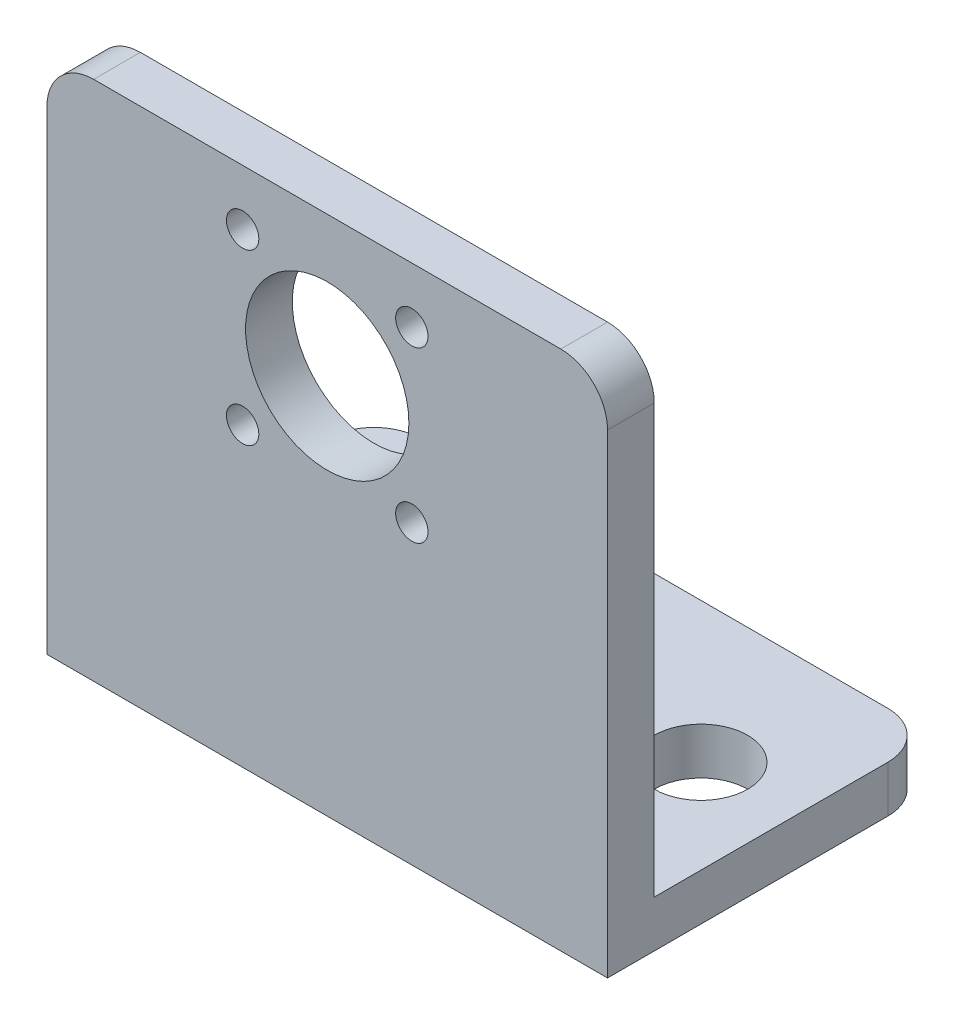
ISO-10303-21;
HEADER;
FILE_DESCRIPTION(('STEP AP214'),'2;1');
FILE_NAME('part.step','',(''),(''),'','','');
FILE_SCHEMA(('AUTOMOTIVE_DESIGN { 1 0 10303 214 1 1 1 1 }'));
ENDSEC;
DATA;
#1=APPLICATION_CONTEXT('core data for automotive mechanical design processes');
#2=APPLICATION_PROTOCOL_DEFINITION('international standard','automotive_design',2000,#1);
#3=PRODUCT_CONTEXT('',#1,'mechanical');
#4=PRODUCT('Part','Part','',(#3));
#5=PRODUCT_RELATED_PRODUCT_CATEGORY('part','',(#4));
#6=PRODUCT_DEFINITION_FORMATION('','',#4);
#7=PRODUCT_DEFINITION_CONTEXT('part definition',#1,'design');
#8=PRODUCT_DEFINITION('design','',#6,#7);
#9=PRODUCT_DEFINITION_SHAPE('','',#8);
#10=(LENGTH_UNIT() NAMED_UNIT(*) SI_UNIT(.MILLI.,.METRE.));
#11=(NAMED_UNIT(*) PLANE_ANGLE_UNIT() SI_UNIT($,.RADIAN.));
#12=(NAMED_UNIT(*) SI_UNIT($,.STERADIAN.) SOLID_ANGLE_UNIT());
#13=UNCERTAINTY_MEASURE_WITH_UNIT(LENGTH_MEASURE(1.E-05),#10,'distance_accuracy_value','');
#14=(GEOMETRIC_REPRESENTATION_CONTEXT(3) GLOBAL_UNCERTAINTY_ASSIGNED_CONTEXT((#13)) GLOBAL_UNIT_ASSIGNED_CONTEXT((#10,
#11,#12)) REPRESENTATION_CONTEXT('',''));
#15=CARTESIAN_POINT('',(0.,0.,0.));
#16=DIRECTION('',(0.,0.,1.));
#17=DIRECTION('',(1.,0.,0.));
#18=AXIS2_PLACEMENT_3D('',#15,#16,#17);
#19=CARTESIAN_POINT('',(0.,0.,0.));
#20=DIRECTION('',(0.,0.,1.));
#21=DIRECTION('',(1.,0.,0.));
#22=AXIS2_PLACEMENT_3D('',#19,#20,#21);
#23=PLANE('',#22);
#24=CARTESIAN_POINT('',(5.75,5.75,0.));
#25=DIRECTION('',(0.,0.,1.));
#26=DIRECTION('',(1.,0.,0.));
#27=AXIS2_PLACEMENT_3D('',#24,#25,#26);
#28=CIRCLE('',#27,1.1);
#29=CARTESIAN_POINT('',(6.85,5.75,0.));
#30=VERTEX_POINT('',#29);
#31=EDGE_CURVE('E350',#30,#30,#28,.T.);
#32=ORIENTED_EDGE('',*,*,#31,.T.);
#33=EDGE_LOOP('',(#32));
#34=FACE_BOUND('',#33,.T.);
#35=CARTESIAN_POINT('',(-5.75,5.75,0.));
#36=DIRECTION('',(0.,0.,1.));
#37=DIRECTION('',(1.,0.,0.));
#38=AXIS2_PLACEMENT_3D('',#35,#36,#37);
#39=CIRCLE('',#38,1.1);
#40=CARTESIAN_POINT('',(-4.65,5.75,0.));
#41=VERTEX_POINT('',#40);
#42=EDGE_CURVE('E342',#41,#41,#39,.T.);
#43=ORIENTED_EDGE('',*,*,#42,.T.);
#44=EDGE_LOOP('',(#43));
#45=FACE_BOUND('',#44,.T.);
#46=CARTESIAN_POINT('',(5.75,-5.75,0.));
#47=DIRECTION('',(0.,0.,1.));
#48=DIRECTION('',(1.,0.,0.));
#49=AXIS2_PLACEMENT_3D('',#46,#47,#48);
#50=CIRCLE('',#49,1.1);
#51=CARTESIAN_POINT('',(6.85,-5.75,0.));
#52=VERTEX_POINT('',#51);
#53=EDGE_CURVE('E337',#52,#52,#50,.T.);
#54=ORIENTED_EDGE('',*,*,#53,.T.);
#55=EDGE_LOOP('',(#54));
#56=FACE_BOUND('',#55,.T.);
#57=CARTESIAN_POINT('',(-5.75,-5.75,0.));
#58=DIRECTION('',(0.,0.,1.));
#59=DIRECTION('',(1.,0.,0.));
#60=AXIS2_PLACEMENT_3D('',#57,#58,#59);
#61=CIRCLE('',#60,1.1);
#62=CARTESIAN_POINT('',(-4.65,-5.75,0.));
#63=VERTEX_POINT('',#62);
#64=EDGE_CURVE('E137',#63,#63,#61,.T.);
#65=ORIENTED_EDGE('',*,*,#64,.T.);
#66=EDGE_LOOP('',(#65));
#67=FACE_BOUND('',#66,.T.);
#68=CARTESIAN_POINT('',(0.,0.,0.));
#69=DIRECTION('',(0.,0.,1.));
#70=DIRECTION('',(1.,0.,0.));
#71=AXIS2_PLACEMENT_3D('',#68,#69,#70);
#72=CIRCLE('',#71,5.55);
#73=CARTESIAN_POINT('',(5.55,0.,0.));
#74=VERTEX_POINT('',#73);
#75=EDGE_CURVE('E147',#74,#74,#72,.T.);
#76=ORIENTED_EDGE('',*,*,#75,.T.);
#77=EDGE_LOOP('',(#76));
#78=FACE_BOUND('',#77,.T.);
#79=DIRECTION('',(0.,-1.,0.));
#80=VECTOR('',#79,1.);
#81=CARTESIAN_POINT('',(-19.05,9.525,0.));
#82=LINE('',#81,#80);
#83=CARTESIAN_POINT('',(-19.05,6.35,0.));
#84=VERTEX_POINT('',#83);
#85=CARTESIAN_POINT('',(-19.05,-22.733,0.));
#86=VERTEX_POINT('',#85);
#87=EDGE_CURVE('E131',#84,#86,#82,.T.);
#88=ORIENTED_EDGE('',*,*,#87,.F.);
#89=CARTESIAN_POINT('',(-15.875,6.35,0.));
#90=DIRECTION('',(0.,0.,1.));
#91=DIRECTION('',(1.,0.,0.));
#92=AXIS2_PLACEMENT_3D('',#89,#90,#91);
#93=CIRCLE('',#92,3.175);
#94=CARTESIAN_POINT('',(-15.875,9.525,0.));
#95=VERTEX_POINT('',#94);
#96=EDGE_CURVE('E191',#84,#95,#93,.F.);
#97=ORIENTED_EDGE('',*,*,#96,.T.);
#98=DIRECTION('',(-1.,0.,0.));
#99=VECTOR('',#98,1.);
#100=CARTESIAN_POINT('',(-19.05,9.525,0.));
#101=LINE('',#100,#99);
#102=CARTESIAN_POINT('',(15.875,9.52500000000001,0.));
#103=VERTEX_POINT('',#102);
#104=EDGE_CURVE('E130',#103,#95,#101,.T.);
#105=ORIENTED_EDGE('',*,*,#104,.F.);
#106=CARTESIAN_POINT('',(15.875,6.35,0.));
#107=DIRECTION('',(0.,0.,1.));
#108=DIRECTION('',(1.,0.,0.));
#109=AXIS2_PLACEMENT_3D('',#106,#107,#108);
#110=CIRCLE('',#109,3.175);
#111=CARTESIAN_POINT('',(19.05,6.35,0.));
#112=VERTEX_POINT('',#111);
#113=EDGE_CURVE('E129',#103,#112,#110,.F.);
#114=ORIENTED_EDGE('',*,*,#113,.T.);
#115=DIRECTION('',(0.,1.,0.));
#116=VECTOR('',#115,1.);
#117=CARTESIAN_POINT('',(19.05,9.52500000000001,0.));
#118=LINE('',#117,#116);
#119=CARTESIAN_POINT('',(19.05,-22.733,0.));
#120=VERTEX_POINT('',#119);
#121=EDGE_CURVE('E114',#120,#112,#118,.T.);
#122=ORIENTED_EDGE('',*,*,#121,.F.);
#123=DIRECTION('',(1.,0.,0.));
#124=VECTOR('',#123,1.);
#125=CARTESIAN_POINT('',(-19.05,-22.733,0.));
#126=LINE('',#125,#124);
#127=EDGE_CURVE('E127',#86,#120,#126,.T.);
#128=ORIENTED_EDGE('',*,*,#127,.F.);
#129=EDGE_LOOP('',(#88,#97,#105,#114,#122,#128));
#130=FACE_BOUND('',#129,.T.);
#131=ADVANCED_FACE('F33',(#34,#45,#56,#67,#78,#130),#23,.F.);
#132=CARTESIAN_POINT('',(0.,0.,3.175));
#133=DIRECTION('',(0.,0.,1.));
#134=DIRECTION('',(1.,0.,0.));
#135=AXIS2_PLACEMENT_3D('',#132,#133,#134);
#136=PLANE('',#135);
#137=CARTESIAN_POINT('',(5.75,5.75,3.175));
#138=DIRECTION('',(0.,0.,1.));
#139=DIRECTION('',(1.,0.,0.));
#140=AXIS2_PLACEMENT_3D('',#137,#138,#139);
#141=CIRCLE('',#140,1.1);
#142=CARTESIAN_POINT('',(6.85,5.75,3.175));
#143=VERTEX_POINT('',#142);
#144=EDGE_CURVE('E352',#143,#143,#141,.T.);
#145=ORIENTED_EDGE('',*,*,#144,.F.);
#146=EDGE_LOOP('',(#145));
#147=FACE_BOUND('',#146,.T.);
#148=CARTESIAN_POINT('',(-5.75,5.75,3.175));
#149=DIRECTION('',(0.,0.,1.));
#150=DIRECTION('',(1.,0.,0.));
#151=AXIS2_PLACEMENT_3D('',#148,#149,#150);
#152=CIRCLE('',#151,1.1);
#153=CARTESIAN_POINT('',(-4.65,5.75,3.175));
#154=VERTEX_POINT('',#153);
#155=EDGE_CURVE('E347',#154,#154,#152,.T.);
#156=ORIENTED_EDGE('',*,*,#155,.F.);
#157=EDGE_LOOP('',(#156));
#158=FACE_BOUND('',#157,.T.);
#159=CARTESIAN_POINT('',(5.75,-5.75,3.175));
#160=DIRECTION('',(0.,0.,1.));
#161=DIRECTION('',(1.,0.,0.));
#162=AXIS2_PLACEMENT_3D('',#159,#160,#161);
#163=CIRCLE('',#162,1.1);
#164=CARTESIAN_POINT('',(6.85,-5.75,3.175));
#165=VERTEX_POINT('',#164);
#166=EDGE_CURVE('E334',#165,#165,#163,.T.);
#167=ORIENTED_EDGE('',*,*,#166,.F.);
#168=EDGE_LOOP('',(#167));
#169=FACE_BOUND('',#168,.T.);
#170=CARTESIAN_POINT('',(-5.75,-5.75,3.175));
#171=DIRECTION('',(0.,0.,1.));
#172=DIRECTION('',(1.,0.,0.));
#173=AXIS2_PLACEMENT_3D('',#170,#171,#172);
#174=CIRCLE('',#173,1.1);
#175=CARTESIAN_POINT('',(-4.65,-5.75,3.175));
#176=VERTEX_POINT('',#175);
#177=EDGE_CURVE('E142',#176,#176,#174,.T.);
#178=ORIENTED_EDGE('',*,*,#177,.F.);
#179=EDGE_LOOP('',(#178));
#180=FACE_BOUND('',#179,.T.);
#181=DIRECTION('',(-1.,0.,0.));
#182=VECTOR('',#181,1.);
#183=CARTESIAN_POINT('',(-19.05,9.525,3.175));
#184=LINE('',#183,#182);
#185=CARTESIAN_POINT('',(15.875,9.52500000000001,3.175));
#186=VERTEX_POINT('',#185);
#187=CARTESIAN_POINT('',(-15.875,9.525,3.175));
#188=VERTEX_POINT('',#187);
#189=EDGE_CURVE('E159',#186,#188,#184,.T.);
#190=ORIENTED_EDGE('',*,*,#189,.T.);
#191=CARTESIAN_POINT('',(-15.875,6.35,3.175));
#192=DIRECTION('',(0.,0.,1.));
#193=DIRECTION('',(1.,0.,0.));
#194=AXIS2_PLACEMENT_3D('',#191,#192,#193);
#195=CIRCLE('',#194,3.175);
#196=CARTESIAN_POINT('',(-19.05,6.35,3.175));
#197=VERTEX_POINT('',#196);
#198=EDGE_CURVE('E11',#188,#197,#195,.T.);
#199=ORIENTED_EDGE('',*,*,#198,.T.);
#200=DIRECTION('',(0.,-1.,0.));
#201=VECTOR('',#200,1.);
#202=CARTESIAN_POINT('',(-19.05,9.525,3.175));
#203=LINE('',#202,#201);
#204=CARTESIAN_POINT('',(-19.05,-25.908,3.175));
#205=VERTEX_POINT('',#204);
#206=EDGE_CURVE('E153',#197,#205,#203,.T.);
#207=ORIENTED_EDGE('',*,*,#206,.T.);
#208=DIRECTION('',(1.,0.,0.));
#209=VECTOR('',#208,1.);
#210=CARTESIAN_POINT('',(-19.05,-25.908,3.175));
#211=LINE('',#210,#209);
#212=CARTESIAN_POINT('',(19.05,-25.908,3.175));
#213=VERTEX_POINT('',#212);
#214=EDGE_CURVE('E155',#205,#213,#211,.T.);
#215=ORIENTED_EDGE('',*,*,#214,.T.);
#216=DIRECTION('',(0.,1.,0.));
#217=VECTOR('',#216,1.);
#218=CARTESIAN_POINT('',(19.05,9.52500000000001,3.175));
#219=LINE('',#218,#217);
#220=CARTESIAN_POINT('',(19.05,6.35,3.175));
#221=VERTEX_POINT('',#220);
#222=EDGE_CURVE('E157',#213,#221,#219,.T.);
#223=ORIENTED_EDGE('',*,*,#222,.T.);
#224=CARTESIAN_POINT('',(15.875,6.35,3.175));
#225=DIRECTION('',(0.,0.,1.));
#226=DIRECTION('',(1.,0.,0.));
#227=AXIS2_PLACEMENT_3D('',#224,#225,#226);
#228=CIRCLE('',#227,3.175);
#229=EDGE_CURVE('E41',#221,#186,#228,.T.);
#230=ORIENTED_EDGE('',*,*,#229,.T.);
#231=EDGE_LOOP('',(#190,#199,#207,#215,#223,#230));
#232=FACE_BOUND('',#231,.T.);
#233=CARTESIAN_POINT('',(0.,0.,3.175));
#234=DIRECTION('',(0.,0.,1.));
#235=DIRECTION('',(1.,0.,0.));
#236=AXIS2_PLACEMENT_3D('',#233,#234,#235);
#237=CIRCLE('',#236,5.55);
#238=CARTESIAN_POINT('',(5.55,0.,3.175));
#239=VERTEX_POINT('',#238);
#240=EDGE_CURVE('E148',#239,#239,#237,.T.);
#241=ORIENTED_EDGE('',*,*,#240,.F.);
#242=EDGE_LOOP('',(#241));
#243=FACE_BOUND('',#242,.T.);
#244=ADVANCED_FACE('F208',(#147,#158,#169,#180,#232,#243),#136,.T.);
#245=CARTESIAN_POINT('',(-19.05,9.525,3.175));
#246=DIRECTION('',(1.,0.,0.));
#247=DIRECTION('',(0.,1.,0.));
#248=AXIS2_PLACEMENT_3D('',#245,#246,#247);
#249=PLANE('',#248);
#250=DIRECTION('',(0.,0.,1.));
#251=VECTOR('',#250,1.);
#252=CARTESIAN_POINT('',(-19.05,-22.733,-19.05));
#253=LINE('',#252,#251);
#254=CARTESIAN_POINT('',(-19.05,-22.733,-15.875));
#255=VERTEX_POINT('',#254);
#256=EDGE_CURVE('E121',#255,#86,#253,.T.);
#257=ORIENTED_EDGE('',*,*,#256,.F.);
#258=DIRECTION('',(0.,1.,0.));
#259=VECTOR('',#258,1.);
#260=CARTESIAN_POINT('',(-19.05,-25.908,-15.875));
#261=LINE('',#260,#259);
#262=CARTESIAN_POINT('',(-19.05,-25.908,-15.875));
#263=VERTEX_POINT('',#262);
#264=EDGE_CURVE('E188',#255,#263,#261,.F.);
#265=ORIENTED_EDGE('',*,*,#264,.T.);
#266=DIRECTION('',(0.,0.,-1.));
#267=VECTOR('',#266,1.);
#268=CARTESIAN_POINT('',(-19.05,-25.908,3.175));
#269=LINE('',#268,#267);
#270=EDGE_CURVE('E165',#205,#263,#269,.T.);
#271=ORIENTED_EDGE('',*,*,#270,.F.);
#272=ORIENTED_EDGE('',*,*,#206,.F.);
#273=DIRECTION('',(0.,0.,-1.));
#274=VECTOR('',#273,1.);
#275=CARTESIAN_POINT('',(-19.05,6.35,3.175));
#276=LINE('',#275,#274);
#277=EDGE_CURVE('E185',#197,#84,#276,.T.);
#278=ORIENTED_EDGE('',*,*,#277,.T.);
#279=ORIENTED_EDGE('',*,*,#87,.T.);
#280=EDGE_LOOP('',(#257,#265,#271,#272,#278,#279));
#281=FACE_BOUND('',#280,.T.);
#282=ADVANCED_FACE('F205',(#281),#249,.F.);
#283=CARTESIAN_POINT('',(-19.05,-25.908,3.175));
#284=DIRECTION('',(0.,1.,0.));
#285=DIRECTION('',(-1.,0.,0.));
#286=AXIS2_PLACEMENT_3D('',#283,#284,#285);
#287=PLANE('',#286);
#288=CARTESIAN_POINT('',(-12.7,-25.908,-9.525));
#289=DIRECTION('',(0.,1.,0.));
#290=DIRECTION('',(0.,0.,1.));
#291=AXIS2_PLACEMENT_3D('',#288,#289,#290);
#292=CIRCLE('',#291,3.175);
#293=CARTESIAN_POINT('',(-12.7,-25.908,-6.35));
#294=VERTEX_POINT('',#293);
#295=EDGE_CURVE('E361',#294,#294,#292,.T.);
#296=ORIENTED_EDGE('',*,*,#295,.T.);
#297=EDGE_LOOP('',(#296));
#298=FACE_BOUND('',#297,.T.);
#299=CARTESIAN_POINT('',(12.7,-25.908,-9.525));
#300=DIRECTION('',(0.,1.,0.));
#301=DIRECTION('',(0.,0.,1.));
#302=AXIS2_PLACEMENT_3D('',#299,#300,#301);
#303=CIRCLE('',#302,3.175);
#304=CARTESIAN_POINT('',(12.7,-25.908,-6.35));
#305=VERTEX_POINT('',#304);
#306=EDGE_CURVE('E355',#305,#305,#303,.T.);
#307=ORIENTED_EDGE('',*,*,#306,.T.);
#308=EDGE_LOOP('',(#307));
#309=FACE_BOUND('',#308,.T.);
#310=DIRECTION('',(-1.,0.,0.));
#311=VECTOR('',#310,1.);
#312=CARTESIAN_POINT('',(-19.05,-25.908,-19.05));
#313=LINE('',#312,#311);
#314=CARTESIAN_POINT('',(15.875,-25.908,-19.05));
#315=VERTEX_POINT('',#314);
#316=CARTESIAN_POINT('',(-15.875,-25.908,-19.05));
#317=VERTEX_POINT('',#316);
#318=EDGE_CURVE('E122',#315,#317,#313,.T.);
#319=ORIENTED_EDGE('',*,*,#318,.F.);
#320=CARTESIAN_POINT('',(15.875,-25.908,-15.875));
#321=DIRECTION('',(0.,1.,0.));
#322=DIRECTION('',(-1.,0.,0.));
#323=AXIS2_PLACEMENT_3D('',#320,#321,#322);
#324=CIRCLE('',#323,3.175);
#325=CARTESIAN_POINT('',(19.05,-25.908,-15.875));
#326=VERTEX_POINT('',#325);
#327=EDGE_CURVE('E176',#315,#326,#324,.F.);
#328=ORIENTED_EDGE('',*,*,#327,.T.);
#329=DIRECTION('',(0.,0.,-1.));
#330=VECTOR('',#329,1.);
#331=CARTESIAN_POINT('',(19.05,-25.908,3.175));
#332=LINE('',#331,#330);
#333=EDGE_CURVE('E161',#213,#326,#332,.T.);
#334=ORIENTED_EDGE('',*,*,#333,.F.);
#335=ORIENTED_EDGE('',*,*,#214,.F.);
#336=ORIENTED_EDGE('',*,*,#270,.T.);
#337=CARTESIAN_POINT('',(-15.875,-25.908,-15.875));
#338=DIRECTION('',(0.,1.,0.));
#339=DIRECTION('',(-1.,0.,0.));
#340=AXIS2_PLACEMENT_3D('',#337,#338,#339);
#341=CIRCLE('',#340,3.175);
#342=EDGE_CURVE('E174',#263,#317,#341,.F.);
#343=ORIENTED_EDGE('',*,*,#342,.T.);
#344=EDGE_LOOP('',(#319,#328,#334,#335,#336,#343));
#345=FACE_BOUND('',#344,.T.);
#346=ADVANCED_FACE('F213',(#298,#309,#345),#287,.F.);
#347=CARTESIAN_POINT('',(19.05,9.52500000000001,3.175));
#348=DIRECTION('',(-1.,0.,0.));
#349=DIRECTION('',(0.,0.,1.));
#350=AXIS2_PLACEMENT_3D('',#347,#348,#349);
#351=PLANE('',#350);
#352=ORIENTED_EDGE('',*,*,#333,.T.);
#353=DIRECTION('',(0.,-1.,0.));
#354=VECTOR('',#353,1.);
#355=CARTESIAN_POINT('',(19.05,-22.733,-15.875));
#356=LINE('',#355,#354);
#357=CARTESIAN_POINT('',(19.05,-22.733,-15.875));
#358=VERTEX_POINT('',#357);
#359=EDGE_CURVE('E117',#326,#358,#356,.F.);
#360=ORIENTED_EDGE('',*,*,#359,.T.);
#361=DIRECTION('',(0.,0.,1.));
#362=VECTOR('',#361,1.);
#363=CARTESIAN_POINT('',(19.05,-22.733,-19.05));
#364=LINE('',#363,#362);
#365=EDGE_CURVE('E110',#358,#120,#364,.T.);
#366=ORIENTED_EDGE('',*,*,#365,.T.);
#367=ORIENTED_EDGE('',*,*,#121,.T.);
#368=DIRECTION('',(0.,0.,-1.));
#369=VECTOR('',#368,1.);
#370=CARTESIAN_POINT('',(19.05,6.35,3.175));
#371=LINE('',#370,#369);
#372=EDGE_CURVE('E178',#112,#221,#371,.F.);
#373=ORIENTED_EDGE('',*,*,#372,.T.);
#374=ORIENTED_EDGE('',*,*,#222,.F.);
#375=EDGE_LOOP('',(#352,#360,#366,#367,#373,#374));
#376=FACE_BOUND('',#375,.T.);
#377=ADVANCED_FACE('F113',(#376),#351,.F.);
#378=CARTESIAN_POINT('',(-19.05,9.525,3.175));
#379=DIRECTION('',(0.,-1.,0.));
#380=DIRECTION('',(1.,0.,0.));
#381=AXIS2_PLACEMENT_3D('',#378,#379,#380);
#382=PLANE('',#381);
#383=ORIENTED_EDGE('',*,*,#104,.T.);
#384=DIRECTION('',(0.,0.,-1.));
#385=VECTOR('',#384,1.);
#386=CARTESIAN_POINT('',(-15.875,9.525,3.175));
#387=LINE('',#386,#385);
#388=EDGE_CURVE('E48',#95,#188,#387,.F.);
#389=ORIENTED_EDGE('',*,*,#388,.T.);
#390=ORIENTED_EDGE('',*,*,#189,.F.);
#391=DIRECTION('',(0.,0.,-1.));
#392=VECTOR('',#391,1.);
#393=CARTESIAN_POINT('',(15.875,9.52500000000001,3.175));
#394=LINE('',#393,#392);
#395=EDGE_CURVE('E193',#186,#103,#394,.T.);
#396=ORIENTED_EDGE('',*,*,#395,.T.);
#397=EDGE_LOOP('',(#383,#389,#390,#396));
#398=FACE_BOUND('',#397,.T.);
#399=ADVANCED_FACE('F197',(#398),#382,.F.);
#400=CARTESIAN_POINT('',(0.,0.,3.175));
#401=DIRECTION('',(0.,0.,-1.));
#402=DIRECTION('',(-1.,0.,0.));
#403=AXIS2_PLACEMENT_3D('',#400,#401,#402);
#404=CYLINDRICAL_SURFACE('',#403,5.55);
#405=ORIENTED_EDGE('',*,*,#240,.T.);
#406=EDGE_LOOP('',(#405));
#407=FACE_BOUND('',#406,.T.);
#408=ORIENTED_EDGE('',*,*,#75,.F.);
#409=EDGE_LOOP('',(#408));
#410=FACE_BOUND('',#409,.T.);
#411=ADVANCED_FACE('F240',(#407,#410),#404,.F.);
#412=CARTESIAN_POINT('',(-19.05,-22.733,-19.05));
#413=DIRECTION('',(0.,-1.,0.));
#414=DIRECTION('',(1.,0.,0.));
#415=AXIS2_PLACEMENT_3D('',#412,#413,#414);
#416=PLANE('',#415);
#417=CARTESIAN_POINT('',(-12.7,-22.733,-9.525));
#418=DIRECTION('',(0.,1.,0.));
#419=DIRECTION('',(0.,0.,1.));
#420=AXIS2_PLACEMENT_3D('',#417,#418,#419);
#421=CIRCLE('',#420,3.17499999999999);
#422=CARTESIAN_POINT('',(-12.7,-22.733,-6.35000000000001));
#423=VERTEX_POINT('',#422);
#424=EDGE_CURVE('E364',#423,#423,#421,.T.);
#425=ORIENTED_EDGE('',*,*,#424,.F.);
#426=EDGE_LOOP('',(#425));
#427=FACE_BOUND('',#426,.T.);
#428=CARTESIAN_POINT('',(12.7,-22.733,-9.525));
#429=DIRECTION('',(0.,1.,0.));
#430=DIRECTION('',(0.,0.,1.));
#431=AXIS2_PLACEMENT_3D('',#428,#429,#430);
#432=CIRCLE('',#431,3.17499999999999);
#433=CARTESIAN_POINT('',(12.7,-22.733,-6.35000000000001));
#434=VERTEX_POINT('',#433);
#435=EDGE_CURVE('E358',#434,#434,#432,.T.);
#436=ORIENTED_EDGE('',*,*,#435,.F.);
#437=EDGE_LOOP('',(#436));
#438=FACE_BOUND('',#437,.T.);
#439=ORIENTED_EDGE('',*,*,#365,.F.);
#440=CARTESIAN_POINT('',(15.875,-22.733,-15.875));
#441=DIRECTION('',(0.,-1.,0.));
#442=DIRECTION('',(1.,0.,0.));
#443=AXIS2_PLACEMENT_3D('',#440,#441,#442);
#444=CIRCLE('',#443,3.175);
#445=CARTESIAN_POINT('',(15.875,-22.733,-19.05));
#446=VERTEX_POINT('',#445);
#447=EDGE_CURVE('E183',#358,#446,#444,.F.);
#448=ORIENTED_EDGE('',*,*,#447,.T.);
#449=DIRECTION('',(1.,0.,0.));
#450=VECTOR('',#449,1.);
#451=CARTESIAN_POINT('',(-19.05,-22.733,-19.05));
#452=LINE('',#451,#450);
#453=CARTESIAN_POINT('',(-15.875,-22.733,-19.05));
#454=VERTEX_POINT('',#453);
#455=EDGE_CURVE('E136',#454,#446,#452,.T.);
#456=ORIENTED_EDGE('',*,*,#455,.F.);
#457=CARTESIAN_POINT('',(-15.875,-22.733,-15.875));
#458=DIRECTION('',(0.,-1.,0.));
#459=DIRECTION('',(1.,0.,0.));
#460=AXIS2_PLACEMENT_3D('',#457,#458,#459);
#461=CIRCLE('',#460,3.175);
#462=EDGE_CURVE('E181',#454,#255,#461,.F.);
#463=ORIENTED_EDGE('',*,*,#462,.T.);
#464=ORIENTED_EDGE('',*,*,#256,.T.);
#465=ORIENTED_EDGE('',*,*,#127,.T.);
#466=EDGE_LOOP('',(#439,#448,#456,#463,#464,#465));
#467=FACE_BOUND('',#466,.T.);
#468=ADVANCED_FACE('F134',(#427,#438,#467),#416,.F.);
#469=CARTESIAN_POINT('',(0.,0.,-19.05));
#470=DIRECTION('',(0.,0.,-1.));
#471=DIRECTION('',(-1.,0.,0.));
#472=AXIS2_PLACEMENT_3D('',#469,#470,#471);
#473=PLANE('',#472);
#474=ORIENTED_EDGE('',*,*,#455,.T.);
#475=DIRECTION('',(0.,-1.,0.));
#476=VECTOR('',#475,1.);
#477=CARTESIAN_POINT('',(15.875,-25.908,-19.05));
#478=LINE('',#477,#476);
#479=EDGE_CURVE('E171',#446,#315,#478,.T.);
#480=ORIENTED_EDGE('',*,*,#479,.T.);
#481=ORIENTED_EDGE('',*,*,#318,.T.);
#482=DIRECTION('',(0.,1.,0.));
#483=VECTOR('',#482,1.);
#484=CARTESIAN_POINT('',(-15.875,-22.733,-19.05));
#485=LINE('',#484,#483);
#486=EDGE_CURVE('E168',#317,#454,#485,.T.);
#487=ORIENTED_EDGE('',*,*,#486,.T.);
#488=EDGE_LOOP('',(#474,#480,#481,#487));
#489=FACE_BOUND('',#488,.T.);
#490=ADVANCED_FACE('F251',(#489),#473,.T.);
#491=CARTESIAN_POINT('',(15.875,0.,-15.875));
#492=DIRECTION('',(0.,1.,0.));
#493=DIRECTION('',(0.,0.,1.));
#494=AXIS2_PLACEMENT_3D('',#491,#492,#493);
#495=CYLINDRICAL_SURFACE('',#494,3.175);
#496=ORIENTED_EDGE('',*,*,#447,.F.);
#497=ORIENTED_EDGE('',*,*,#359,.F.);
#498=ORIENTED_EDGE('',*,*,#327,.F.);
#499=ORIENTED_EDGE('',*,*,#479,.F.);
#500=EDGE_LOOP('',(#496,#497,#498,#499));
#501=FACE_BOUND('',#500,.T.);
#502=ADVANCED_FACE('F248',(#501),#495,.T.);
#503=CARTESIAN_POINT('',(-15.875,0.,-15.875));
#504=DIRECTION('',(0.,-1.,0.));
#505=DIRECTION('',(1.,0.,0.));
#506=AXIS2_PLACEMENT_3D('',#503,#504,#505);
#507=CYLINDRICAL_SURFACE('',#506,3.175);
#508=ORIENTED_EDGE('',*,*,#342,.F.);
#509=ORIENTED_EDGE('',*,*,#264,.F.);
#510=ORIENTED_EDGE('',*,*,#462,.F.);
#511=ORIENTED_EDGE('',*,*,#486,.F.);
#512=EDGE_LOOP('',(#508,#509,#510,#511));
#513=FACE_BOUND('',#512,.T.);
#514=ADVANCED_FACE('F225',(#513),#507,.T.);
#515=CARTESIAN_POINT('',(-15.875,6.35,3.175));
#516=DIRECTION('',(0.,0.,-1.));
#517=DIRECTION('',(-1.,0.,0.));
#518=AXIS2_PLACEMENT_3D('',#515,#516,#517);
#519=CYLINDRICAL_SURFACE('',#518,3.175);
#520=ORIENTED_EDGE('',*,*,#198,.F.);
#521=ORIENTED_EDGE('',*,*,#388,.F.);
#522=ORIENTED_EDGE('',*,*,#96,.F.);
#523=ORIENTED_EDGE('',*,*,#277,.F.);
#524=EDGE_LOOP('',(#520,#521,#522,#523));
#525=FACE_BOUND('',#524,.T.);
#526=ADVANCED_FACE('F202',(#525),#519,.T.);
#527=CARTESIAN_POINT('',(15.875,6.35,3.175));
#528=DIRECTION('',(0.,0.,-1.));
#529=DIRECTION('',(-1.,0.,0.));
#530=AXIS2_PLACEMENT_3D('',#527,#528,#529);
#531=CYLINDRICAL_SURFACE('',#530,3.175);
#532=ORIENTED_EDGE('',*,*,#229,.F.);
#533=ORIENTED_EDGE('',*,*,#372,.F.);
#534=ORIENTED_EDGE('',*,*,#113,.F.);
#535=ORIENTED_EDGE('',*,*,#395,.F.);
#536=EDGE_LOOP('',(#532,#533,#534,#535));
#537=FACE_BOUND('',#536,.T.);
#538=ADVANCED_FACE('F35',(#537),#531,.T.);
#539=CARTESIAN_POINT('',(-5.75,-5.75,3.175));
#540=DIRECTION('',(0.,0.,1.));
#541=DIRECTION('',(1.,0.,0.));
#542=AXIS2_PLACEMENT_3D('',#539,#540,#541);
#543=CYLINDRICAL_SURFACE('',#542,1.1);
#544=ORIENTED_EDGE('',*,*,#177,.T.);
#545=EDGE_LOOP('',(#544));
#546=FACE_BOUND('',#545,.T.);
#547=ORIENTED_EDGE('',*,*,#64,.F.);
#548=EDGE_LOOP('',(#547));
#549=FACE_BOUND('',#548,.T.);
#550=ADVANCED_FACE('F217',(#546,#549),#543,.F.);
#551=CARTESIAN_POINT('',(5.75,-5.75,3.175));
#552=DIRECTION('',(0.,0.,1.));
#553=DIRECTION('',(1.,0.,0.));
#554=AXIS2_PLACEMENT_3D('',#551,#552,#553);
#555=CYLINDRICAL_SURFACE('',#554,1.1);
#556=ORIENTED_EDGE('',*,*,#166,.T.);
#557=EDGE_LOOP('',(#556));
#558=FACE_BOUND('',#557,.T.);
#559=ORIENTED_EDGE('',*,*,#53,.F.);
#560=EDGE_LOOP('',(#559));
#561=FACE_BOUND('',#560,.T.);
#562=ADVANCED_FACE('F222',(#558,#561),#555,.F.);
#563=CARTESIAN_POINT('',(-5.75,5.75,3.175));
#564=DIRECTION('',(0.,0.,1.));
#565=DIRECTION('',(1.,0.,0.));
#566=AXIS2_PLACEMENT_3D('',#563,#564,#565);
#567=CYLINDRICAL_SURFACE('',#566,1.1);
#568=ORIENTED_EDGE('',*,*,#155,.T.);
#569=EDGE_LOOP('',(#568));
#570=FACE_BOUND('',#569,.T.);
#571=ORIENTED_EDGE('',*,*,#42,.F.);
#572=EDGE_LOOP('',(#571));
#573=FACE_BOUND('',#572,.T.);
#574=ADVANCED_FACE('F323',(#570,#573),#567,.F.);
#575=CARTESIAN_POINT('',(5.75,5.75,3.175));
#576=DIRECTION('',(0.,0.,1.));
#577=DIRECTION('',(1.,0.,0.));
#578=AXIS2_PLACEMENT_3D('',#575,#576,#577);
#579=CYLINDRICAL_SURFACE('',#578,1.1);
#580=ORIENTED_EDGE('',*,*,#144,.T.);
#581=EDGE_LOOP('',(#580));
#582=FACE_BOUND('',#581,.T.);
#583=ORIENTED_EDGE('',*,*,#31,.F.);
#584=EDGE_LOOP('',(#583));
#585=FACE_BOUND('',#584,.T.);
#586=ADVANCED_FACE('F303',(#582,#585),#579,.F.);
#587=CARTESIAN_POINT('',(12.7,-22.733,-9.525));
#588=DIRECTION('',(0.,1.,0.));
#589=DIRECTION('',(0.,0.,1.));
#590=AXIS2_PLACEMENT_3D('',#587,#588,#589);
#591=CYLINDRICAL_SURFACE('',#590,3.17499999999999);
#592=ORIENTED_EDGE('',*,*,#306,.F.);
#593=EDGE_LOOP('',(#592));
#594=FACE_BOUND('',#593,.T.);
#595=ORIENTED_EDGE('',*,*,#435,.T.);
#596=EDGE_LOOP('',(#595));
#597=FACE_BOUND('',#596,.T.);
#598=ADVANCED_FACE('F297',(#594,#597),#591,.F.);
#599=CARTESIAN_POINT('',(-12.7,-22.733,-9.525));
#600=DIRECTION('',(0.,1.,0.));
#601=DIRECTION('',(0.,0.,1.));
#602=AXIS2_PLACEMENT_3D('',#599,#600,#601);
#603=CYLINDRICAL_SURFACE('',#602,3.17499999999999);
#604=ORIENTED_EDGE('',*,*,#295,.F.);
#605=EDGE_LOOP('',(#604));
#606=FACE_BOUND('',#605,.T.);
#607=ORIENTED_EDGE('',*,*,#424,.T.);
#608=EDGE_LOOP('',(#607));
#609=FACE_BOUND('',#608,.T.);
#610=ADVANCED_FACE('F302',(#606,#609),#603,.F.);
#611=CLOSED_SHELL('',(#131,#244,#282,#346,#377,#399,#411,#468,#490,#502,#514,#526,#538,#550,
#562,#574,#586,#598,#610));
#612=MANIFOLD_SOLID_BREP('B2',#611);
#613=ADVANCED_BREP_SHAPE_REPRESENTATION('',(#18,#612),#14);
#614=SHAPE_DEFINITION_REPRESENTATION(#9,#613);
ENDSEC;
END-ISO-10303-21;
